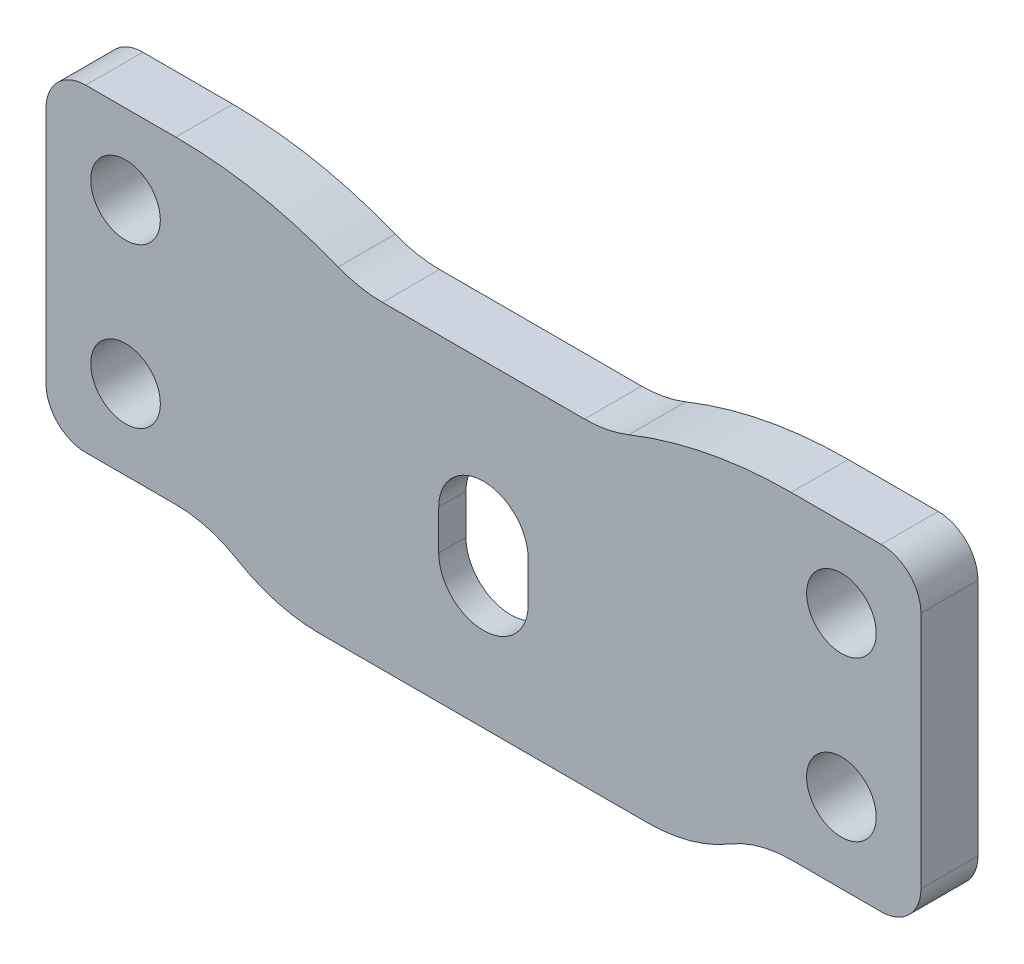
ISO-10303-21;
HEADER;
FILE_DESCRIPTION(('STEP AP214'),'2;1');
FILE_NAME('part.step','',(''),(''),'','','');
FILE_SCHEMA(('AUTOMOTIVE_DESIGN { 1 0 10303 214 1 1 1 1 }'));
ENDSEC;
DATA;
#1=APPLICATION_CONTEXT('core data for automotive mechanical design processes');
#2=APPLICATION_PROTOCOL_DEFINITION('international standard','automotive_design',2000,#1);
#3=PRODUCT_CONTEXT('',#1,'mechanical');
#4=PRODUCT('Part','Part','',(#3));
#5=PRODUCT_RELATED_PRODUCT_CATEGORY('part','',(#4));
#6=PRODUCT_DEFINITION_FORMATION('','',#4);
#7=PRODUCT_DEFINITION_CONTEXT('part definition',#1,'design');
#8=PRODUCT_DEFINITION('design','',#6,#7);
#9=PRODUCT_DEFINITION_SHAPE('','',#8);
#10=(LENGTH_UNIT() NAMED_UNIT(*) SI_UNIT(.MILLI.,.METRE.));
#11=(NAMED_UNIT(*) PLANE_ANGLE_UNIT() SI_UNIT($,.RADIAN.));
#12=(NAMED_UNIT(*) SI_UNIT($,.STERADIAN.) SOLID_ANGLE_UNIT());
#13=UNCERTAINTY_MEASURE_WITH_UNIT(LENGTH_MEASURE(1.E-05),#10,'distance_accuracy_value','');
#14=(GEOMETRIC_REPRESENTATION_CONTEXT(3) GLOBAL_UNCERTAINTY_ASSIGNED_CONTEXT((#13)) GLOBAL_UNIT_ASSIGNED_CONTEXT((#10,
#11,#12)) REPRESENTATION_CONTEXT('',''));
#15=CARTESIAN_POINT('',(0.,0.,0.));
#16=DIRECTION('',(0.,0.,1.));
#17=DIRECTION('',(1.,0.,0.));
#18=AXIS2_PLACEMENT_3D('',#15,#16,#17);
#19=CARTESIAN_POINT('',(34.925,12.7,4.55422));
#20=DIRECTION('',(0.,-1.,0.));
#21=DIRECTION('',(1.,0.,0.));
#22=AXIS2_PLACEMENT_3D('',#19,#20,#21);
#23=PLANE('',#22);
#24=DIRECTION('',(0.,0.,1.));
#25=VECTOR('',#24,1.);
#26=CARTESIAN_POINT('',(24.5620158285618,12.7,4.55422));
#27=LINE('',#26,#25);
#28=CARTESIAN_POINT('',(24.5620158285618,12.7,4.55422));
#29=VERTEX_POINT('',#28);
#30=CARTESIAN_POINT('',(24.5620158285618,12.7,0.));
#31=VERTEX_POINT('',#30);
#32=EDGE_CURVE('E260',#29,#31,#27,.F.);
#33=ORIENTED_EDGE('',*,*,#32,.F.);
#34=DIRECTION('',(-1.,0.,0.));
#35=VECTOR('',#34,1.);
#36=CARTESIAN_POINT('',(34.925,12.7,4.55422));
#37=LINE('',#36,#35);
#38=CARTESIAN_POINT('',(31.75,12.7,4.55422));
#39=VERTEX_POINT('',#38);
#40=EDGE_CURVE('E336',#39,#29,#37,.T.);
#41=ORIENTED_EDGE('',*,*,#40,.F.);
#42=DIRECTION('',(0.,0.,-1.));
#43=VECTOR('',#42,1.);
#44=CARTESIAN_POINT('',(31.75,12.7,4.55422));
#45=LINE('',#44,#43);
#46=CARTESIAN_POINT('',(31.75,12.7,0.));
#47=VERTEX_POINT('',#46);
#48=EDGE_CURVE('E383',#39,#47,#45,.T.);
#49=ORIENTED_EDGE('',*,*,#48,.T.);
#50=DIRECTION('',(-1.,0.,0.));
#51=VECTOR('',#50,1.);
#52=CARTESIAN_POINT('',(34.925,12.7,0.));
#53=LINE('',#52,#51);
#54=EDGE_CURVE('E328',#47,#31,#53,.T.);
#55=ORIENTED_EDGE('',*,*,#54,.T.);
#56=EDGE_LOOP('',(#33,#41,#49,#55));
#57=FACE_BOUND('',#56,.T.);
#58=ADVANCED_FACE('F38',(#57),#23,.F.);
#59=CARTESIAN_POINT('',(-34.925,-12.7,4.55422));
#60=DIRECTION('',(0.,0.,-1.));
#61=DIRECTION('',(-1.,0.,0.));
#62=AXIS2_PLACEMENT_3D('',#59,#60,#61);
#63=PLANE('',#62);
#64=DIRECTION('',(0.,-1.,0.));
#65=VECTOR('',#64,1.);
#66=CARTESIAN_POINT('',(-3.571875,-2.38125000000001,4.55422));
#67=LINE('',#66,#65);
#68=CARTESIAN_POINT('',(-3.571875,-2.38125000000001,4.55422));
#69=VERTEX_POINT('',#68);
#70=CARTESIAN_POINT('',(-3.571875,-5.55625000000001,4.55422));
#71=VERTEX_POINT('',#70);
#72=EDGE_CURVE('E203',#69,#71,#67,.T.);
#73=ORIENTED_EDGE('',*,*,#72,.F.);
#74=CARTESIAN_POINT('',(0.,-2.38125000000001,4.55422));
#75=DIRECTION('',(0.,0.,1.));
#76=DIRECTION('',(1.,0.,0.));
#77=AXIS2_PLACEMENT_3D('',#74,#75,#76);
#78=CIRCLE('',#77,3.571875);
#79=CARTESIAN_POINT('',(3.571875,-2.38125000000001,4.55422));
#80=VERTEX_POINT('',#79);
#81=EDGE_CURVE('E209',#80,#69,#78,.T.);
#82=ORIENTED_EDGE('',*,*,#81,.F.);
#83=DIRECTION('',(0.,1.,0.));
#84=VECTOR('',#83,1.);
#85=CARTESIAN_POINT('',(3.571875,-2.38125000000001,4.55422));
#86=LINE('',#85,#84);
#87=CARTESIAN_POINT('',(3.571875,-5.55625000000001,4.55422));
#88=VERTEX_POINT('',#87);
#89=EDGE_CURVE('E238',#88,#80,#86,.T.);
#90=ORIENTED_EDGE('',*,*,#89,.F.);
#91=CARTESIAN_POINT('',(0.,-5.55625000000001,4.55422));
#92=DIRECTION('',(0.,0.,1.));
#93=DIRECTION('',(1.,0.,0.));
#94=AXIS2_PLACEMENT_3D('',#91,#92,#93);
#95=CIRCLE('',#94,3.571875);
#96=EDGE_CURVE('E211',#71,#88,#95,.T.);
#97=ORIENTED_EDGE('',*,*,#96,.F.);
#98=EDGE_LOOP('',(#73,#82,#90,#97));
#99=FACE_BOUND('',#98,.T.);
#100=CARTESIAN_POINT('',(28.575,-6.35,4.55422));
#101=DIRECTION('',(0.,0.,1.));
#102=DIRECTION('',(1.,0.,0.));
#103=AXIS2_PLACEMENT_3D('',#100,#101,#102);
#104=CIRCLE('',#103,2.778125);
#105=CARTESIAN_POINT('',(31.353125,-6.35,4.55422));
#106=VERTEX_POINT('',#105);
#107=EDGE_CURVE('E317',#106,#106,#104,.T.);
#108=ORIENTED_EDGE('',*,*,#107,.F.);
#109=EDGE_LOOP('',(#108));
#110=FACE_BOUND('',#109,.T.);
#111=CARTESIAN_POINT('',(28.575,6.35000000000001,4.55422));
#112=DIRECTION('',(0.,0.,1.));
#113=DIRECTION('',(1.,0.,0.));
#114=AXIS2_PLACEMENT_3D('',#111,#112,#113);
#115=CIRCLE('',#114,2.778125);
#116=CARTESIAN_POINT('',(31.353125,6.35000000000001,4.55422));
#117=VERTEX_POINT('',#116);
#118=EDGE_CURVE('E311',#117,#117,#115,.T.);
#119=ORIENTED_EDGE('',*,*,#118,.F.);
#120=EDGE_LOOP('',(#119));
#121=FACE_BOUND('',#120,.T.);
#122=CARTESIAN_POINT('',(-28.575,-6.35,4.55422));
#123=DIRECTION('',(0.,0.,1.));
#124=DIRECTION('',(1.,0.,0.));
#125=AXIS2_PLACEMENT_3D('',#122,#123,#124);
#126=CIRCLE('',#125,2.778125);
#127=CARTESIAN_POINT('',(-25.796875,-6.35,4.55422));
#128=VERTEX_POINT('',#127);
#129=EDGE_CURVE('E305',#128,#128,#126,.T.);
#130=ORIENTED_EDGE('',*,*,#129,.F.);
#131=EDGE_LOOP('',(#130));
#132=FACE_BOUND('',#131,.T.);
#133=CARTESIAN_POINT('',(-28.575,6.35000000000001,4.55422));
#134=DIRECTION('',(0.,0.,1.));
#135=DIRECTION('',(1.,0.,0.));
#136=AXIS2_PLACEMENT_3D('',#133,#134,#135);
#137=CIRCLE('',#136,2.778125);
#138=CARTESIAN_POINT('',(-25.796875,6.35000000000001,4.55422));
#139=VERTEX_POINT('',#138);
#140=EDGE_CURVE('E297',#139,#139,#137,.T.);
#141=ORIENTED_EDGE('',*,*,#140,.F.);
#142=EDGE_LOOP('',(#141));
#143=FACE_BOUND('',#142,.T.);
#144=CARTESIAN_POINT('',(-24.5620158285618,-22.225,4.55422));
#145=DIRECTION('',(0.,0.,-1.));
#146=DIRECTION('',(-1.,0.,0.));
#147=AXIS2_PLACEMENT_3D('',#144,#145,#146);
#148=CIRCLE('',#147,9.525);
#149=CARTESIAN_POINT('',(-24.5620158285618,-12.7,4.55422));
#150=VERTEX_POINT('',#149);
#151=CARTESIAN_POINT('',(-19.6558907001626,-14.0607142857143,4.55422));
#152=VERTEX_POINT('',#151);
#153=EDGE_CURVE('E398',#150,#152,#148,.T.);
#154=ORIENTED_EDGE('',*,*,#153,.T.);
#155=CARTESIAN_POINT('',(-13.1143905289636,-3.17500000000001,4.55422));
#156=DIRECTION('',(0.,0.,-1.));
#157=DIRECTION('',(-1.,0.,0.));
#158=AXIS2_PLACEMENT_3D('',#155,#156,#157);
#159=CIRCLE('',#158,12.7);
#160=CARTESIAN_POINT('',(-13.1143905289636,-15.875,4.55422));
#161=VERTEX_POINT('',#160);
#162=EDGE_CURVE('E46',#152,#161,#159,.F.);
#163=ORIENTED_EDGE('',*,*,#162,.T.);
#164=DIRECTION('',(-1.,0.,0.));
#165=VECTOR('',#164,1.);
#166=CARTESIAN_POINT('',(17.4625,-15.875,4.55422));
#167=LINE('',#166,#165);
#168=CARTESIAN_POINT('',(13.1143905289637,-15.875,4.55422));
#169=VERTEX_POINT('',#168);
#170=EDGE_CURVE('E294',#169,#161,#167,.T.);
#171=ORIENTED_EDGE('',*,*,#170,.F.);
#172=CARTESIAN_POINT('',(13.1143905289637,-3.17500000000001,4.55422));
#173=DIRECTION('',(0.,0.,-1.));
#174=DIRECTION('',(-1.,0.,0.));
#175=AXIS2_PLACEMENT_3D('',#172,#173,#174);
#176=CIRCLE('',#175,12.7);
#177=CARTESIAN_POINT('',(19.6558907001626,-14.0607142857143,4.55422));
#178=VERTEX_POINT('',#177);
#179=EDGE_CURVE('E53',#169,#178,#176,.F.);
#180=ORIENTED_EDGE('',*,*,#179,.T.);
#181=CARTESIAN_POINT('',(24.5620158285619,-22.225,4.55422));
#182=DIRECTION('',(0.,0.,-1.));
#183=DIRECTION('',(-1.,0.,0.));
#184=AXIS2_PLACEMENT_3D('',#181,#182,#183);
#185=CIRCLE('',#184,9.525);
#186=CARTESIAN_POINT('',(24.5620158285619,-12.7,4.55422));
#187=VERTEX_POINT('',#186);
#188=EDGE_CURVE('E403',#178,#187,#185,.T.);
#189=ORIENTED_EDGE('',*,*,#188,.T.);
#190=DIRECTION('',(1.,0.,0.));
#191=VECTOR('',#190,1.);
#192=CARTESIAN_POINT('',(34.925,-12.7,4.55422));
#193=LINE('',#192,#191);
#194=CARTESIAN_POINT('',(31.75,-12.7,4.55422));
#195=VERTEX_POINT('',#194);
#196=EDGE_CURVE('E327',#187,#195,#193,.T.);
#197=ORIENTED_EDGE('',*,*,#196,.T.);
#198=CARTESIAN_POINT('',(31.75,-9.52499999999999,4.55422));
#199=DIRECTION('',(0.,0.,-1.));
#200=DIRECTION('',(-1.,0.,0.));
#201=AXIS2_PLACEMENT_3D('',#198,#199,#200);
#202=CIRCLE('',#201,3.175);
#203=CARTESIAN_POINT('',(34.925,-9.52499999999999,4.55422));
#204=VERTEX_POINT('',#203);
#205=EDGE_CURVE('E378',#195,#204,#202,.F.);
#206=ORIENTED_EDGE('',*,*,#205,.T.);
#207=DIRECTION('',(0.,1.,0.));
#208=VECTOR('',#207,1.);
#209=CARTESIAN_POINT('',(34.925,12.7,4.55422));
#210=LINE('',#209,#208);
#211=CARTESIAN_POINT('',(34.925,9.52500000000001,4.55422));
#212=VERTEX_POINT('',#211);
#213=EDGE_CURVE('E332',#204,#212,#210,.T.);
#214=ORIENTED_EDGE('',*,*,#213,.T.);
#215=CARTESIAN_POINT('',(31.75,9.52500000000001,4.55422));
#216=DIRECTION('',(0.,0.,-1.));
#217=DIRECTION('',(-1.,0.,0.));
#218=AXIS2_PLACEMENT_3D('',#215,#216,#217);
#219=CIRCLE('',#218,3.175);
#220=EDGE_CURVE('E376',#212,#39,#219,.F.);
#221=ORIENTED_EDGE('',*,*,#220,.T.);
#222=ORIENTED_EDGE('',*,*,#40,.T.);
#223=CARTESIAN_POINT('',(24.5620158285619,-22.225,4.55422));
#224=DIRECTION('',(0.,0.,-1.));
#225=DIRECTION('',(-1.,0.,0.));
#226=AXIS2_PLACEMENT_3D('',#223,#224,#225);
#227=CIRCLE('',#226,34.925);
#228=CARTESIAN_POINT('',(11.5994713026312,10.2053571428571,4.55422));
#229=VERTEX_POINT('',#228);
#230=EDGE_CURVE('E249',#229,#29,#227,.T.);
#231=ORIENTED_EDGE('',*,*,#230,.F.);
#232=CARTESIAN_POINT('',(8.06423188646827,19.05,4.55422));
#233=DIRECTION('',(0.,0.,-1.));
#234=DIRECTION('',(-1.,0.,0.));
#235=AXIS2_PLACEMENT_3D('',#232,#233,#234);
#236=CIRCLE('',#235,9.525);
#237=CARTESIAN_POINT('',(8.06423188646827,9.52499999999999,4.55422));
#238=VERTEX_POINT('',#237);
#239=EDGE_CURVE('E256',#238,#229,#236,.F.);
#240=ORIENTED_EDGE('',*,*,#239,.F.);
#241=DIRECTION('',(1.,0.,0.));
#242=VECTOR('',#241,1.);
#243=CARTESIAN_POINT('',(8.06423188646827,9.52499999999999,4.55422));
#244=LINE('',#243,#242);
#245=CARTESIAN_POINT('',(-8.06423188646825,9.52499999999999,4.55422));
#246=VERTEX_POINT('',#245);
#247=EDGE_CURVE('E274',#246,#238,#244,.T.);
#248=ORIENTED_EDGE('',*,*,#247,.F.);
#249=CARTESIAN_POINT('',(-8.06423188646825,19.05,4.55422));
#250=DIRECTION('',(0.,0.,-1.));
#251=DIRECTION('',(-1.,0.,0.));
#252=AXIS2_PLACEMENT_3D('',#249,#250,#251);
#253=CIRCLE('',#252,9.525);
#254=CARTESIAN_POINT('',(-11.5994713026312,10.2053571428571,4.55422));
#255=VERTEX_POINT('',#254);
#256=EDGE_CURVE('E272',#255,#246,#253,.F.);
#257=ORIENTED_EDGE('',*,*,#256,.F.);
#258=CARTESIAN_POINT('',(-24.5620158285618,-22.225,4.55422));
#259=DIRECTION('',(0.,0.,-1.));
#260=DIRECTION('',(-1.,0.,0.));
#261=AXIS2_PLACEMENT_3D('',#258,#259,#260);
#262=CIRCLE('',#261,34.925);
#263=CARTESIAN_POINT('',(-24.5620158285618,12.7,4.55422));
#264=VERTEX_POINT('',#263);
#265=EDGE_CURVE('E270',#264,#255,#262,.T.);
#266=ORIENTED_EDGE('',*,*,#265,.F.);
#267=CARTESIAN_POINT('',(-31.75,12.7,4.55422));
#268=VERTEX_POINT('',#267);
#269=EDGE_CURVE('E335',#264,#268,#37,.T.);
#270=ORIENTED_EDGE('',*,*,#269,.T.);
#271=CARTESIAN_POINT('',(-31.75,9.525,4.55422));
#272=DIRECTION('',(0.,0.,-1.));
#273=DIRECTION('',(-1.,0.,0.));
#274=AXIS2_PLACEMENT_3D('',#271,#272,#273);
#275=CIRCLE('',#274,3.175);
#276=CARTESIAN_POINT('',(-34.925,9.525,4.55422));
#277=VERTEX_POINT('',#276);
#278=EDGE_CURVE('E372',#268,#277,#275,.F.);
#279=ORIENTED_EDGE('',*,*,#278,.T.);
#280=DIRECTION('',(0.,-1.,0.));
#281=VECTOR('',#280,1.);
#282=CARTESIAN_POINT('',(-34.925,12.7,4.55422));
#283=LINE('',#282,#281);
#284=CARTESIAN_POINT('',(-34.925,-9.525,4.55422));
#285=VERTEX_POINT('',#284);
#286=EDGE_CURVE('E324',#277,#285,#283,.T.);
#287=ORIENTED_EDGE('',*,*,#286,.T.);
#288=CARTESIAN_POINT('',(-31.75,-9.525,4.55422));
#289=DIRECTION('',(0.,0.,-1.));
#290=DIRECTION('',(-1.,0.,0.));
#291=AXIS2_PLACEMENT_3D('',#288,#289,#290);
#292=CIRCLE('',#291,3.175);
#293=CARTESIAN_POINT('',(-31.75,-12.7,4.55422));
#294=VERTEX_POINT('',#293);
#295=EDGE_CURVE('E374',#285,#294,#292,.F.);
#296=ORIENTED_EDGE('',*,*,#295,.T.);
#297=EDGE_CURVE('E329',#294,#150,#193,.T.);
#298=ORIENTED_EDGE('',*,*,#297,.T.);
#299=EDGE_LOOP('',(#154,#163,#171,#180,#189,#197,#206,#214,#221,#222,#231,#240,#248,#257,#266,
#270,#279,#287,#296,#298));
#300=FACE_BOUND('',#299,.T.);
#301=ADVANCED_FACE('F205',(#99,#110,#121,#132,#143,#300),#63,.F.);
#302=CARTESIAN_POINT('',(-34.925,-12.7,0.));
#303=DIRECTION('',(0.,0.,-1.));
#304=DIRECTION('',(-1.,0.,0.));
#305=AXIS2_PLACEMENT_3D('',#302,#303,#304);
#306=PLANE('',#305);
#307=CARTESIAN_POINT('',(0.,-3.17500000000001,0.));
#308=DIRECTION('',(0.,0.,-1.));
#309=DIRECTION('',(-1.,0.,0.));
#310=AXIS2_PLACEMENT_3D('',#307,#308,#309);
#311=CIRCLE('',#310,9.525);
#312=CARTESIAN_POINT('',(-9.525,-3.17500000000001,0.));
#313=VERTEX_POINT('',#312);
#314=EDGE_CURVE('E245',#313,#313,#311,.T.);
#315=ORIENTED_EDGE('',*,*,#314,.F.);
#316=EDGE_LOOP('',(#315));
#317=FACE_BOUND('',#316,.T.);
#318=CARTESIAN_POINT('',(-28.575,6.35000000000001,0.));
#319=DIRECTION('',(0.,0.,-1.));
#320=DIRECTION('',(-1.,0.,0.));
#321=AXIS2_PLACEMENT_3D('',#318,#319,#320);
#322=CIRCLE('',#321,2.778125);
#323=CARTESIAN_POINT('',(-31.353125,6.35000000000001,0.));
#324=VERTEX_POINT('',#323);
#325=EDGE_CURVE('E302',#324,#324,#322,.T.);
#326=ORIENTED_EDGE('',*,*,#325,.F.);
#327=EDGE_LOOP('',(#326));
#328=FACE_BOUND('',#327,.T.);
#329=CARTESIAN_POINT('',(-28.575,-6.35,0.));
#330=DIRECTION('',(0.,0.,-1.));
#331=DIRECTION('',(-1.,0.,0.));
#332=AXIS2_PLACEMENT_3D('',#329,#330,#331);
#333=CIRCLE('',#332,2.778125);
#334=CARTESIAN_POINT('',(-31.353125,-6.35,0.));
#335=VERTEX_POINT('',#334);
#336=EDGE_CURVE('E308',#335,#335,#333,.T.);
#337=ORIENTED_EDGE('',*,*,#336,.F.);
#338=EDGE_LOOP('',(#337));
#339=FACE_BOUND('',#338,.T.);
#340=CARTESIAN_POINT('',(28.575,6.35000000000001,0.));
#341=DIRECTION('',(0.,0.,-1.));
#342=DIRECTION('',(-1.,0.,0.));
#343=AXIS2_PLACEMENT_3D('',#340,#341,#342);
#344=CIRCLE('',#343,2.778125);
#345=CARTESIAN_POINT('',(25.796875,6.35000000000001,0.));
#346=VERTEX_POINT('',#345);
#347=EDGE_CURVE('E314',#346,#346,#344,.T.);
#348=ORIENTED_EDGE('',*,*,#347,.F.);
#349=EDGE_LOOP('',(#348));
#350=FACE_BOUND('',#349,.T.);
#351=CARTESIAN_POINT('',(28.575,-6.35,0.));
#352=DIRECTION('',(0.,0.,-1.));
#353=DIRECTION('',(-1.,0.,0.));
#354=AXIS2_PLACEMENT_3D('',#351,#352,#353);
#355=CIRCLE('',#354,2.778125);
#356=CARTESIAN_POINT('',(25.796875,-6.35,0.));
#357=VERTEX_POINT('',#356);
#358=EDGE_CURVE('E320',#357,#357,#355,.T.);
#359=ORIENTED_EDGE('',*,*,#358,.F.);
#360=EDGE_LOOP('',(#359));
#361=FACE_BOUND('',#360,.T.);
#362=DIRECTION('',(-1.,0.,0.));
#363=VECTOR('',#362,1.);
#364=CARTESIAN_POINT('',(17.4625,-15.875,0.));
#365=LINE('',#364,#363);
#366=CARTESIAN_POINT('',(13.1143905289637,-15.875,0.));
#367=VERTEX_POINT('',#366);
#368=CARTESIAN_POINT('',(-13.1143905289636,-15.875,0.));
#369=VERTEX_POINT('',#368);
#370=EDGE_CURVE('E292',#367,#369,#365,.T.);
#371=ORIENTED_EDGE('',*,*,#370,.T.);
#372=CARTESIAN_POINT('',(-13.1143905289636,-3.17500000000001,0.));
#373=DIRECTION('',(0.,0.,-1.));
#374=DIRECTION('',(-1.,0.,0.));
#375=AXIS2_PLACEMENT_3D('',#372,#373,#374);
#376=CIRCLE('',#375,12.7);
#377=CARTESIAN_POINT('',(-19.6558907001626,-14.0607142857143,0.));
#378=VERTEX_POINT('',#377);
#379=EDGE_CURVE('E412',#369,#378,#376,.T.);
#380=ORIENTED_EDGE('',*,*,#379,.T.);
#381=CARTESIAN_POINT('',(-24.5620158285618,-22.225,0.));
#382=DIRECTION('',(0.,0.,-1.));
#383=DIRECTION('',(-1.,0.,0.));
#384=AXIS2_PLACEMENT_3D('',#381,#382,#383);
#385=CIRCLE('',#384,9.525);
#386=CARTESIAN_POINT('',(-24.5620158285618,-12.7,0.));
#387=VERTEX_POINT('',#386);
#388=EDGE_CURVE('E396',#378,#387,#385,.F.);
#389=ORIENTED_EDGE('',*,*,#388,.T.);
#390=DIRECTION('',(1.,0.,0.));
#391=VECTOR('',#390,1.);
#392=CARTESIAN_POINT('',(34.925,-12.7,0.));
#393=LINE('',#392,#391);
#394=CARTESIAN_POINT('',(-31.75,-12.7,0.));
#395=VERTEX_POINT('',#394);
#396=EDGE_CURVE('E343',#395,#387,#393,.T.);
#397=ORIENTED_EDGE('',*,*,#396,.F.);
#398=CARTESIAN_POINT('',(-31.75,-9.525,0.));
#399=DIRECTION('',(0.,0.,-1.));
#400=DIRECTION('',(-1.,0.,0.));
#401=AXIS2_PLACEMENT_3D('',#398,#399,#400);
#402=CIRCLE('',#401,3.175);
#403=CARTESIAN_POINT('',(-34.925,-9.525,0.));
#404=VERTEX_POINT('',#403);
#405=EDGE_CURVE('E359',#395,#404,#402,.T.);
#406=ORIENTED_EDGE('',*,*,#405,.T.);
#407=DIRECTION('',(0.,-1.,0.));
#408=VECTOR('',#407,1.);
#409=CARTESIAN_POINT('',(-34.925,12.7,0.));
#410=LINE('',#409,#408);
#411=CARTESIAN_POINT('',(-34.925,9.525,0.));
#412=VERTEX_POINT('',#411);
#413=EDGE_CURVE('E323',#412,#404,#410,.T.);
#414=ORIENTED_EDGE('',*,*,#413,.F.);
#415=CARTESIAN_POINT('',(-31.75,9.525,0.));
#416=DIRECTION('',(0.,0.,-1.));
#417=DIRECTION('',(-1.,0.,0.));
#418=AXIS2_PLACEMENT_3D('',#415,#416,#417);
#419=CIRCLE('',#418,3.175);
#420=CARTESIAN_POINT('',(-31.75,12.7,0.));
#421=VERTEX_POINT('',#420);
#422=EDGE_CURVE('E356',#412,#421,#419,.T.);
#423=ORIENTED_EDGE('',*,*,#422,.T.);
#424=CARTESIAN_POINT('',(-24.5620158285618,12.7,0.));
#425=VERTEX_POINT('',#424);
#426=EDGE_CURVE('E349',#425,#421,#53,.T.);
#427=ORIENTED_EDGE('',*,*,#426,.F.);
#428=CARTESIAN_POINT('',(-24.5620158285618,-22.225,0.));
#429=DIRECTION('',(0.,0.,-1.));
#430=DIRECTION('',(-1.,0.,0.));
#431=AXIS2_PLACEMENT_3D('',#428,#429,#430);
#432=CIRCLE('',#431,34.925);
#433=CARTESIAN_POINT('',(-11.5994713026312,10.2053571428571,0.));
#434=VERTEX_POINT('',#433);
#435=EDGE_CURVE('E255',#425,#434,#432,.T.);
#436=ORIENTED_EDGE('',*,*,#435,.T.);
#437=CARTESIAN_POINT('',(-8.06423188646825,19.05,0.));
#438=DIRECTION('',(0.,0.,-1.));
#439=DIRECTION('',(-1.,0.,0.));
#440=AXIS2_PLACEMENT_3D('',#437,#438,#439);
#441=CIRCLE('',#440,9.525);
#442=CARTESIAN_POINT('',(-8.06423188646825,9.52499999999999,0.));
#443=VERTEX_POINT('',#442);
#444=EDGE_CURVE('E264',#434,#443,#441,.F.);
#445=ORIENTED_EDGE('',*,*,#444,.T.);
#446=DIRECTION('',(-1.,0.,0.));
#447=VECTOR('',#446,1.);
#448=CARTESIAN_POINT('',(-34.925,9.52499999999999,0.));
#449=LINE('',#448,#447);
#450=CARTESIAN_POINT('',(8.06423188646827,9.52499999999999,0.));
#451=VERTEX_POINT('',#450);
#452=EDGE_CURVE('E261',#443,#451,#449,.F.);
#453=ORIENTED_EDGE('',*,*,#452,.T.);
#454=CARTESIAN_POINT('',(8.06423188646827,19.05,0.));
#455=DIRECTION('',(0.,0.,-1.));
#456=DIRECTION('',(-1.,0.,0.));
#457=AXIS2_PLACEMENT_3D('',#454,#455,#456);
#458=CIRCLE('',#457,9.525);
#459=CARTESIAN_POINT('',(11.5994713026312,10.2053571428571,0.));
#460=VERTEX_POINT('',#459);
#461=EDGE_CURVE('E257',#451,#460,#458,.F.);
#462=ORIENTED_EDGE('',*,*,#461,.T.);
#463=CARTESIAN_POINT('',(24.5620158285619,-22.225,0.));
#464=DIRECTION('',(0.,0.,-1.));
#465=DIRECTION('',(-1.,0.,0.));
#466=AXIS2_PLACEMENT_3D('',#463,#464,#465);
#467=CIRCLE('',#466,34.925);
#468=EDGE_CURVE('E252',#460,#31,#467,.T.);
#469=ORIENTED_EDGE('',*,*,#468,.T.);
#470=ORIENTED_EDGE('',*,*,#54,.F.);
#471=CARTESIAN_POINT('',(31.75,9.52500000000001,0.));
#472=DIRECTION('',(0.,0.,-1.));
#473=DIRECTION('',(-1.,0.,0.));
#474=AXIS2_PLACEMENT_3D('',#471,#472,#473);
#475=CIRCLE('',#474,3.175);
#476=CARTESIAN_POINT('',(34.925,9.52500000000001,0.));
#477=VERTEX_POINT('',#476);
#478=EDGE_CURVE('E361',#47,#477,#475,.T.);
#479=ORIENTED_EDGE('',*,*,#478,.T.);
#480=DIRECTION('',(0.,1.,0.));
#481=VECTOR('',#480,1.);
#482=CARTESIAN_POINT('',(34.925,12.7,0.));
#483=LINE('',#482,#481);
#484=CARTESIAN_POINT('',(34.925,-9.52499999999999,0.));
#485=VERTEX_POINT('',#484);
#486=EDGE_CURVE('E346',#485,#477,#483,.T.);
#487=ORIENTED_EDGE('',*,*,#486,.F.);
#488=CARTESIAN_POINT('',(31.75,-9.52499999999999,0.));
#489=DIRECTION('',(0.,0.,-1.));
#490=DIRECTION('',(-1.,0.,0.));
#491=AXIS2_PLACEMENT_3D('',#488,#489,#490);
#492=CIRCLE('',#491,3.175);
#493=CARTESIAN_POINT('',(31.75,-12.7,0.));
#494=VERTEX_POINT('',#493);
#495=EDGE_CURVE('E363',#485,#494,#492,.T.);
#496=ORIENTED_EDGE('',*,*,#495,.T.);
#497=CARTESIAN_POINT('',(24.5620158285619,-12.7,0.));
#498=VERTEX_POINT('',#497);
#499=EDGE_CURVE('E342',#498,#494,#393,.T.);
#500=ORIENTED_EDGE('',*,*,#499,.F.);
#501=CARTESIAN_POINT('',(24.5620158285619,-22.225,0.));
#502=DIRECTION('',(0.,0.,-1.));
#503=DIRECTION('',(-1.,0.,0.));
#504=AXIS2_PLACEMENT_3D('',#501,#502,#503);
#505=CIRCLE('',#504,9.525);
#506=CARTESIAN_POINT('',(19.6558907001626,-14.0607142857143,0.));
#507=VERTEX_POINT('',#506);
#508=EDGE_CURVE('E400',#498,#507,#505,.F.);
#509=ORIENTED_EDGE('',*,*,#508,.T.);
#510=CARTESIAN_POINT('',(13.1143905289637,-3.17500000000001,0.));
#511=DIRECTION('',(0.,0.,-1.));
#512=DIRECTION('',(-1.,0.,0.));
#513=AXIS2_PLACEMENT_3D('',#510,#511,#512);
#514=CIRCLE('',#513,12.7);
#515=EDGE_CURVE('E410',#507,#367,#514,.T.);
#516=ORIENTED_EDGE('',*,*,#515,.T.);
#517=EDGE_LOOP('',(#371,#380,#389,#397,#406,#414,#423,#427,#436,#445,#453,#462,#469,#470,#479,
#487,#496,#500,#509,#516));
#518=FACE_BOUND('',#517,.T.);
#519=ADVANCED_FACE('F424',(#317,#328,#339,#350,#361,#518),#306,.T.);
#520=CARTESIAN_POINT('',(34.925,-12.7,4.55422));
#521=DIRECTION('',(0.,1.,0.));
#522=DIRECTION('',(-1.,0.,0.));
#523=AXIS2_PLACEMENT_3D('',#520,#521,#522);
#524=PLANE('',#523);
#525=ORIENTED_EDGE('',*,*,#196,.F.);
#526=DIRECTION('',(0.,0.,-1.));
#527=VECTOR('',#526,1.);
#528=CARTESIAN_POINT('',(24.5620158285619,-12.7,4.55422));
#529=LINE('',#528,#527);
#530=EDGE_CURVE('E393',#187,#498,#529,.T.);
#531=ORIENTED_EDGE('',*,*,#530,.T.);
#532=ORIENTED_EDGE('',*,*,#499,.T.);
#533=DIRECTION('',(0.,0.,-1.));
#534=VECTOR('',#533,1.);
#535=CARTESIAN_POINT('',(31.75,-12.7,4.55422));
#536=LINE('',#535,#534);
#537=EDGE_CURVE('E369',#494,#195,#536,.F.);
#538=ORIENTED_EDGE('',*,*,#537,.T.);
#539=EDGE_LOOP('',(#525,#531,#532,#538));
#540=FACE_BOUND('',#539,.T.);
#541=ADVANCED_FACE('F489',(#540),#524,.F.);
#542=CARTESIAN_POINT('',(-34.925,12.7,4.55422));
#543=DIRECTION('',(1.,0.,0.));
#544=DIRECTION('',(0.,0.,-1.));
#545=AXIS2_PLACEMENT_3D('',#542,#543,#544);
#546=PLANE('',#545);
#547=ORIENTED_EDGE('',*,*,#413,.T.);
#548=DIRECTION('',(0.,0.,-1.));
#549=VECTOR('',#548,1.);
#550=CARTESIAN_POINT('',(-34.925,-9.525,4.55422));
#551=LINE('',#550,#549);
#552=EDGE_CURVE('E389',#404,#285,#551,.F.);
#553=ORIENTED_EDGE('',*,*,#552,.T.);
#554=ORIENTED_EDGE('',*,*,#286,.F.);
#555=DIRECTION('',(0.,0.,-1.));
#556=VECTOR('',#555,1.);
#557=CARTESIAN_POINT('',(-34.925,9.525,4.55422));
#558=LINE('',#557,#556);
#559=EDGE_CURVE('E386',#277,#412,#558,.T.);
#560=ORIENTED_EDGE('',*,*,#559,.T.);
#561=EDGE_LOOP('',(#547,#553,#554,#560));
#562=FACE_BOUND('',#561,.T.);
#563=ADVANCED_FACE('F439',(#562),#546,.F.);
#564=ORIENTED_EDGE('',*,*,#396,.T.);
#565=DIRECTION('',(0.,0.,1.));
#566=VECTOR('',#565,1.);
#567=CARTESIAN_POINT('',(-24.5620158285618,-12.7,4.55422));
#568=LINE('',#567,#566);
#569=EDGE_CURVE('E391',#387,#150,#568,.T.);
#570=ORIENTED_EDGE('',*,*,#569,.T.);
#571=ORIENTED_EDGE('',*,*,#297,.F.);
#572=DIRECTION('',(0.,0.,-1.));
#573=VECTOR('',#572,1.);
#574=CARTESIAN_POINT('',(-31.75,-12.7,4.55422));
#575=LINE('',#574,#573);
#576=EDGE_CURVE('E366',#294,#395,#575,.T.);
#577=ORIENTED_EDGE('',*,*,#576,.T.);
#578=EDGE_LOOP('',(#564,#570,#571,#577));
#579=FACE_BOUND('',#578,.T.);
#580=ADVANCED_FACE('F430',(#579),#524,.F.);
#581=CARTESIAN_POINT('',(34.925,12.7,4.55422));
#582=DIRECTION('',(-1.,0.,0.));
#583=DIRECTION('',(0.,-1.,0.));
#584=AXIS2_PLACEMENT_3D('',#581,#582,#583);
#585=PLANE('',#584);
#586=ORIENTED_EDGE('',*,*,#213,.F.);
#587=DIRECTION('',(0.,0.,-1.));
#588=VECTOR('',#587,1.);
#589=CARTESIAN_POINT('',(34.925,-9.52499999999999,4.55422));
#590=LINE('',#589,#588);
#591=EDGE_CURVE('E353',#204,#485,#590,.T.);
#592=ORIENTED_EDGE('',*,*,#591,.T.);
#593=ORIENTED_EDGE('',*,*,#486,.T.);
#594=DIRECTION('',(0.,0.,-1.));
#595=VECTOR('',#594,1.);
#596=CARTESIAN_POINT('',(34.925,9.52500000000001,4.55422));
#597=LINE('',#596,#595);
#598=EDGE_CURVE('E339',#477,#212,#597,.F.);
#599=ORIENTED_EDGE('',*,*,#598,.T.);
#600=EDGE_LOOP('',(#586,#592,#593,#599));
#601=FACE_BOUND('',#600,.T.);
#602=ADVANCED_FACE('F480',(#601),#585,.F.);
#603=ORIENTED_EDGE('',*,*,#269,.F.);
#604=DIRECTION('',(0.,0.,1.));
#605=VECTOR('',#604,1.);
#606=CARTESIAN_POINT('',(-24.5620158285618,12.7,4.55422));
#607=LINE('',#606,#605);
#608=EDGE_CURVE('E289',#264,#425,#607,.F.);
#609=ORIENTED_EDGE('',*,*,#608,.T.);
#610=ORIENTED_EDGE('',*,*,#426,.T.);
#611=DIRECTION('',(0.,0.,-1.));
#612=VECTOR('',#611,1.);
#613=CARTESIAN_POINT('',(-31.75,12.7,4.55422));
#614=LINE('',#613,#612);
#615=EDGE_CURVE('E380',#421,#268,#614,.F.);
#616=ORIENTED_EDGE('',*,*,#615,.T.);
#617=EDGE_LOOP('',(#603,#609,#610,#616));
#618=FACE_BOUND('',#617,.T.);
#619=ADVANCED_FACE('F448',(#618),#23,.F.);
#620=CARTESIAN_POINT('',(28.575,-6.35,4.55422));
#621=DIRECTION('',(0.,0.,1.));
#622=DIRECTION('',(1.,0.,0.));
#623=AXIS2_PLACEMENT_3D('',#620,#621,#622);
#624=CYLINDRICAL_SURFACE('',#623,2.778125);
#625=ORIENTED_EDGE('',*,*,#107,.T.);
#626=EDGE_LOOP('',(#625));
#627=FACE_BOUND('',#626,.T.);
#628=ORIENTED_EDGE('',*,*,#358,.T.);
#629=EDGE_LOOP('',(#628));
#630=FACE_BOUND('',#629,.T.);
#631=ADVANCED_FACE('F512',(#627,#630),#624,.F.);
#632=CARTESIAN_POINT('',(28.575,6.35000000000001,4.55422));
#633=DIRECTION('',(0.,0.,1.));
#634=DIRECTION('',(1.,0.,0.));
#635=AXIS2_PLACEMENT_3D('',#632,#633,#634);
#636=CYLINDRICAL_SURFACE('',#635,2.778125);
#637=ORIENTED_EDGE('',*,*,#118,.T.);
#638=EDGE_LOOP('',(#637));
#639=FACE_BOUND('',#638,.T.);
#640=ORIENTED_EDGE('',*,*,#347,.T.);
#641=EDGE_LOOP('',(#640));
#642=FACE_BOUND('',#641,.T.);
#643=ADVANCED_FACE('F517',(#639,#642),#636,.F.);
#644=CARTESIAN_POINT('',(-28.575,-6.35,4.55422));
#645=DIRECTION('',(0.,0.,1.));
#646=DIRECTION('',(1.,0.,0.));
#647=AXIS2_PLACEMENT_3D('',#644,#645,#646);
#648=CYLINDRICAL_SURFACE('',#647,2.778125);
#649=ORIENTED_EDGE('',*,*,#129,.T.);
#650=EDGE_LOOP('',(#649));
#651=FACE_BOUND('',#650,.T.);
#652=ORIENTED_EDGE('',*,*,#336,.T.);
#653=EDGE_LOOP('',(#652));
#654=FACE_BOUND('',#653,.T.);
#655=ADVANCED_FACE('F553',(#651,#654),#648,.F.);
#656=CARTESIAN_POINT('',(-28.575,6.35000000000001,4.55422));
#657=DIRECTION('',(0.,0.,1.));
#658=DIRECTION('',(1.,0.,0.));
#659=AXIS2_PLACEMENT_3D('',#656,#657,#658);
#660=CYLINDRICAL_SURFACE('',#659,2.778125);
#661=ORIENTED_EDGE('',*,*,#140,.T.);
#662=EDGE_LOOP('',(#661));
#663=FACE_BOUND('',#662,.T.);
#664=ORIENTED_EDGE('',*,*,#325,.T.);
#665=EDGE_LOOP('',(#664));
#666=FACE_BOUND('',#665,.T.);
#667=ADVANCED_FACE('F529',(#663,#666),#660,.F.);
#668=CARTESIAN_POINT('',(31.75,-9.52499999999999,4.55422));
#669=DIRECTION('',(0.,0.,-1.));
#670=DIRECTION('',(-1.,0.,0.));
#671=AXIS2_PLACEMENT_3D('',#668,#669,#670);
#672=CYLINDRICAL_SURFACE('',#671,3.175);
#673=ORIENTED_EDGE('',*,*,#205,.F.);
#674=ORIENTED_EDGE('',*,*,#537,.F.);
#675=ORIENTED_EDGE('',*,*,#495,.F.);
#676=ORIENTED_EDGE('',*,*,#591,.F.);
#677=EDGE_LOOP('',(#673,#674,#675,#676));
#678=FACE_BOUND('',#677,.T.);
#679=ADVANCED_FACE('F484',(#678),#672,.T.);
#680=CARTESIAN_POINT('',(31.75,9.52500000000001,4.55422));
#681=DIRECTION('',(0.,0.,-1.));
#682=DIRECTION('',(-1.,0.,0.));
#683=AXIS2_PLACEMENT_3D('',#680,#681,#682);
#684=CYLINDRICAL_SURFACE('',#683,3.175);
#685=ORIENTED_EDGE('',*,*,#220,.F.);
#686=ORIENTED_EDGE('',*,*,#598,.F.);
#687=ORIENTED_EDGE('',*,*,#478,.F.);
#688=ORIENTED_EDGE('',*,*,#48,.F.);
#689=EDGE_LOOP('',(#685,#686,#687,#688));
#690=FACE_BOUND('',#689,.T.);
#691=ADVANCED_FACE('F475',(#690),#684,.T.);
#692=CARTESIAN_POINT('',(-31.75,-9.525,4.55422));
#693=DIRECTION('',(0.,0.,-1.));
#694=DIRECTION('',(-1.,0.,0.));
#695=AXIS2_PLACEMENT_3D('',#692,#693,#694);
#696=CYLINDRICAL_SURFACE('',#695,3.175);
#697=ORIENTED_EDGE('',*,*,#295,.F.);
#698=ORIENTED_EDGE('',*,*,#552,.F.);
#699=ORIENTED_EDGE('',*,*,#405,.F.);
#700=ORIENTED_EDGE('',*,*,#576,.F.);
#701=EDGE_LOOP('',(#697,#698,#699,#700));
#702=FACE_BOUND('',#701,.T.);
#703=ADVANCED_FACE('F436',(#702),#696,.T.);
#704=CARTESIAN_POINT('',(-31.75,9.525,4.55422));
#705=DIRECTION('',(0.,0.,-1.));
#706=DIRECTION('',(-1.,0.,0.));
#707=AXIS2_PLACEMENT_3D('',#704,#705,#706);
#708=CYLINDRICAL_SURFACE('',#707,3.175);
#709=ORIENTED_EDGE('',*,*,#278,.F.);
#710=ORIENTED_EDGE('',*,*,#615,.F.);
#711=ORIENTED_EDGE('',*,*,#422,.F.);
#712=ORIENTED_EDGE('',*,*,#559,.F.);
#713=EDGE_LOOP('',(#709,#710,#711,#712));
#714=FACE_BOUND('',#713,.T.);
#715=ADVANCED_FACE('F443',(#714),#708,.T.);
#716=CARTESIAN_POINT('',(17.4625,-15.875,4.55422));
#717=DIRECTION('',(0.,-1.,0.));
#718=DIRECTION('',(0.,0.,-1.));
#719=AXIS2_PLACEMENT_3D('',#716,#717,#718);
#720=PLANE('',#719);
#721=ORIENTED_EDGE('',*,*,#170,.T.);
#722=DIRECTION('',(0.,0.,-1.));
#723=VECTOR('',#722,1.);
#724=CARTESIAN_POINT('',(-13.1143905289636,-15.875,0.));
#725=LINE('',#724,#723);
#726=EDGE_CURVE('E407',#161,#369,#725,.T.);
#727=ORIENTED_EDGE('',*,*,#726,.T.);
#728=ORIENTED_EDGE('',*,*,#370,.F.);
#729=DIRECTION('',(0.,0.,1.));
#730=VECTOR('',#729,1.);
#731=CARTESIAN_POINT('',(13.1143905289637,-15.875,4.55422));
#732=LINE('',#731,#730);
#733=EDGE_CURVE('E405',#367,#169,#732,.T.);
#734=ORIENTED_EDGE('',*,*,#733,.T.);
#735=EDGE_LOOP('',(#721,#727,#728,#734));
#736=FACE_BOUND('',#735,.T.);
#737=ADVANCED_FACE('F419',(#736),#720,.T.);
#738=CARTESIAN_POINT('',(-24.5620158285618,-22.225,4.55422));
#739=DIRECTION('',(0.,0.,1.));
#740=DIRECTION('',(1.,0.,0.));
#741=AXIS2_PLACEMENT_3D('',#738,#739,#740);
#742=CYLINDRICAL_SURFACE('',#741,9.525);
#743=ORIENTED_EDGE('',*,*,#388,.F.);
#744=DIRECTION('',(0.,0.,1.));
#745=VECTOR('',#744,1.);
#746=CARTESIAN_POINT('',(-19.6558907001626,-14.0607142857143,4.55422));
#747=LINE('',#746,#745);
#748=EDGE_CURVE('E61',#378,#152,#747,.T.);
#749=ORIENTED_EDGE('',*,*,#748,.T.);
#750=ORIENTED_EDGE('',*,*,#153,.F.);
#751=ORIENTED_EDGE('',*,*,#569,.F.);
#752=EDGE_LOOP('',(#743,#749,#750,#751));
#753=FACE_BOUND('',#752,.T.);
#754=ADVANCED_FACE('F427',(#753),#742,.F.);
#755=CARTESIAN_POINT('',(24.5620158285619,-22.225,4.55422));
#756=DIRECTION('',(0.,0.,-1.));
#757=DIRECTION('',(-1.,0.,0.));
#758=AXIS2_PLACEMENT_3D('',#755,#756,#757);
#759=CYLINDRICAL_SURFACE('',#758,9.525);
#760=ORIENTED_EDGE('',*,*,#188,.F.);
#761=DIRECTION('',(0.,0.,-1.));
#762=VECTOR('',#761,1.);
#763=CARTESIAN_POINT('',(19.6558907001626,-14.0607142857143,4.55422));
#764=LINE('',#763,#762);
#765=EDGE_CURVE('E11',#178,#507,#764,.T.);
#766=ORIENTED_EDGE('',*,*,#765,.T.);
#767=ORIENTED_EDGE('',*,*,#508,.F.);
#768=ORIENTED_EDGE('',*,*,#530,.F.);
#769=EDGE_LOOP('',(#760,#766,#767,#768));
#770=FACE_BOUND('',#769,.T.);
#771=ADVANCED_FACE('F492',(#770),#759,.F.);
#772=CARTESIAN_POINT('',(-24.5620158285618,-22.225,4.55422));
#773=DIRECTION('',(0.,0.,-1.));
#774=DIRECTION('',(-1.,0.,0.));
#775=AXIS2_PLACEMENT_3D('',#772,#773,#774);
#776=CYLINDRICAL_SURFACE('',#775,34.925);
#777=ORIENTED_EDGE('',*,*,#608,.F.);
#778=ORIENTED_EDGE('',*,*,#265,.T.);
#779=DIRECTION('',(0.,0.,1.));
#780=VECTOR('',#779,1.);
#781=CARTESIAN_POINT('',(-11.5994713026312,10.2053571428571,4.55422));
#782=LINE('',#781,#780);
#783=EDGE_CURVE('E286',#255,#434,#782,.F.);
#784=ORIENTED_EDGE('',*,*,#783,.T.);
#785=ORIENTED_EDGE('',*,*,#435,.F.);
#786=EDGE_LOOP('',(#777,#778,#784,#785));
#787=FACE_BOUND('',#786,.T.);
#788=ADVANCED_FACE('F451',(#787),#776,.T.);
#789=CARTESIAN_POINT('',(-8.06423188646825,19.05,4.55422));
#790=DIRECTION('',(0.,0.,-1.));
#791=DIRECTION('',(-1.,0.,0.));
#792=AXIS2_PLACEMENT_3D('',#789,#790,#791);
#793=CYLINDRICAL_SURFACE('',#792,9.525);
#794=ORIENTED_EDGE('',*,*,#783,.F.);
#795=ORIENTED_EDGE('',*,*,#256,.T.);
#796=DIRECTION('',(0.,0.,1.));
#797=VECTOR('',#796,1.);
#798=CARTESIAN_POINT('',(-8.06423188646825,9.52499999999999,4.55422));
#799=LINE('',#798,#797);
#800=EDGE_CURVE('E283',#246,#443,#799,.F.);
#801=ORIENTED_EDGE('',*,*,#800,.T.);
#802=ORIENTED_EDGE('',*,*,#444,.F.);
#803=EDGE_LOOP('',(#794,#795,#801,#802));
#804=FACE_BOUND('',#803,.T.);
#805=ADVANCED_FACE('F458',(#804),#793,.F.);
#806=CARTESIAN_POINT('',(8.06423188646827,9.52499999999999,4.55422));
#807=DIRECTION('',(0.,1.,0.));
#808=DIRECTION('',(1.,0.,0.));
#809=AXIS2_PLACEMENT_3D('',#806,#807,#808);
#810=PLANE('',#809);
#811=ORIENTED_EDGE('',*,*,#800,.F.);
#812=ORIENTED_EDGE('',*,*,#247,.T.);
#813=DIRECTION('',(0.,0.,1.));
#814=VECTOR('',#813,1.);
#815=CARTESIAN_POINT('',(8.06423188646827,9.52499999999999,4.55422));
#816=LINE('',#815,#814);
#817=EDGE_CURVE('E280',#238,#451,#816,.F.);
#818=ORIENTED_EDGE('',*,*,#817,.T.);
#819=ORIENTED_EDGE('',*,*,#452,.F.);
#820=EDGE_LOOP('',(#811,#812,#818,#819));
#821=FACE_BOUND('',#820,.T.);
#822=ADVANCED_FACE('F460',(#821),#810,.T.);
#823=CARTESIAN_POINT('',(8.06423188646827,19.05,4.55422));
#824=DIRECTION('',(0.,0.,-1.));
#825=DIRECTION('',(-1.,0.,0.));
#826=AXIS2_PLACEMENT_3D('',#823,#824,#825);
#827=CYLINDRICAL_SURFACE('',#826,9.525);
#828=ORIENTED_EDGE('',*,*,#817,.F.);
#829=ORIENTED_EDGE('',*,*,#239,.T.);
#830=DIRECTION('',(0.,0.,1.));
#831=VECTOR('',#830,1.);
#832=CARTESIAN_POINT('',(11.5994713026312,10.2053571428571,4.55422));
#833=LINE('',#832,#831);
#834=EDGE_CURVE('E277',#229,#460,#833,.F.);
#835=ORIENTED_EDGE('',*,*,#834,.T.);
#836=ORIENTED_EDGE('',*,*,#461,.F.);
#837=EDGE_LOOP('',(#828,#829,#835,#836));
#838=FACE_BOUND('',#837,.T.);
#839=ADVANCED_FACE('F464',(#838),#827,.F.);
#840=CARTESIAN_POINT('',(24.5620158285619,-22.225,4.55422));
#841=DIRECTION('',(0.,0.,-1.));
#842=DIRECTION('',(-1.,0.,0.));
#843=AXIS2_PLACEMENT_3D('',#840,#841,#842);
#844=CYLINDRICAL_SURFACE('',#843,34.925);
#845=ORIENTED_EDGE('',*,*,#834,.F.);
#846=ORIENTED_EDGE('',*,*,#230,.T.);
#847=ORIENTED_EDGE('',*,*,#32,.T.);
#848=ORIENTED_EDGE('',*,*,#468,.F.);
#849=EDGE_LOOP('',(#845,#846,#847,#848));
#850=FACE_BOUND('',#849,.T.);
#851=ADVANCED_FACE('F468',(#850),#844,.T.);
#852=CARTESIAN_POINT('',(0.,-3.17500000000001,2.38125));
#853=DIRECTION('',(0.,0.,-1.));
#854=DIRECTION('',(-1.,0.,0.));
#855=AXIS2_PLACEMENT_3D('',#852,#853,#854);
#856=CYLINDRICAL_SURFACE('',#855,9.525);
#857=CARTESIAN_POINT('',(0.,-3.17500000000001,2.38125));
#858=DIRECTION('',(0.,0.,-1.));
#859=DIRECTION('',(-1.,0.,0.));
#860=AXIS2_PLACEMENT_3D('',#857,#858,#859);
#861=CIRCLE('',#860,9.525);
#862=CARTESIAN_POINT('',(-9.525,-3.17500000000001,2.38125));
#863=VERTEX_POINT('',#862);
#864=EDGE_CURVE('E246',#863,#863,#861,.T.);
#865=ORIENTED_EDGE('',*,*,#864,.F.);
#866=EDGE_LOOP('',(#865));
#867=FACE_BOUND('',#866,.T.);
#868=ORIENTED_EDGE('',*,*,#314,.T.);
#869=EDGE_LOOP('',(#868));
#870=FACE_BOUND('',#869,.T.);
#871=ADVANCED_FACE('F579',(#867,#870),#856,.F.);
#872=CARTESIAN_POINT('',(0.,-3.17500000000001,2.38125));
#873=DIRECTION('',(0.,0.,-1.));
#874=DIRECTION('',(-1.,0.,0.));
#875=AXIS2_PLACEMENT_3D('',#872,#873,#874);
#876=PLANE('',#875);
#877=CARTESIAN_POINT('',(0.,-2.38125000000001,2.38125));
#878=DIRECTION('',(0.,0.,-1.));
#879=DIRECTION('',(-1.,0.,0.));
#880=AXIS2_PLACEMENT_3D('',#877,#878,#879);
#881=CIRCLE('',#880,3.571875);
#882=CARTESIAN_POINT('',(3.571875,-2.38125000000001,2.38125));
#883=VERTEX_POINT('',#882);
#884=CARTESIAN_POINT('',(-3.571875,-2.38125000000001,2.38125));
#885=VERTEX_POINT('',#884);
#886=EDGE_CURVE('E224',#883,#885,#881,.F.);
#887=ORIENTED_EDGE('',*,*,#886,.T.);
#888=DIRECTION('',(0.,-1.,0.));
#889=VECTOR('',#888,1.);
#890=CARTESIAN_POINT('',(-3.571875,-2.38125000000001,2.38125));
#891=LINE('',#890,#889);
#892=CARTESIAN_POINT('',(-3.571875,-5.55625000000001,2.38125));
#893=VERTEX_POINT('',#892);
#894=EDGE_CURVE('E219',#885,#893,#891,.T.);
#895=ORIENTED_EDGE('',*,*,#894,.T.);
#896=CARTESIAN_POINT('',(0.,-5.55625000000001,2.38125));
#897=DIRECTION('',(0.,0.,-1.));
#898=DIRECTION('',(-1.,0.,0.));
#899=AXIS2_PLACEMENT_3D('',#896,#897,#898);
#900=CIRCLE('',#899,3.571875);
#901=CARTESIAN_POINT('',(3.571875,-5.55625000000001,2.38125));
#902=VERTEX_POINT('',#901);
#903=EDGE_CURVE('E232',#893,#902,#900,.F.);
#904=ORIENTED_EDGE('',*,*,#903,.T.);
#905=DIRECTION('',(0.,1.,0.));
#906=VECTOR('',#905,1.);
#907=CARTESIAN_POINT('',(3.571875,-2.38125000000001,2.38125));
#908=LINE('',#907,#906);
#909=EDGE_CURVE('E213',#902,#883,#908,.T.);
#910=ORIENTED_EDGE('',*,*,#909,.T.);
#911=EDGE_LOOP('',(#887,#895,#904,#910));
#912=FACE_BOUND('',#911,.T.);
#913=ORIENTED_EDGE('',*,*,#864,.T.);
#914=EDGE_LOOP('',(#913));
#915=FACE_BOUND('',#914,.T.);
#916=ADVANCED_FACE('F502',(#912,#915),#876,.T.);
#917=CARTESIAN_POINT('',(-13.1143905289636,-3.17500000000001,4.55422));
#918=DIRECTION('',(0.,0.,1.));
#919=DIRECTION('',(1.,0.,0.));
#920=AXIS2_PLACEMENT_3D('',#917,#918,#919);
#921=CYLINDRICAL_SURFACE('',#920,12.7);
#922=ORIENTED_EDGE('',*,*,#162,.F.);
#923=ORIENTED_EDGE('',*,*,#748,.F.);
#924=ORIENTED_EDGE('',*,*,#379,.F.);
#925=ORIENTED_EDGE('',*,*,#726,.F.);
#926=EDGE_LOOP('',(#922,#923,#924,#925));
#927=FACE_BOUND('',#926,.T.);
#928=ADVANCED_FACE('F422',(#927),#921,.T.);
#929=CARTESIAN_POINT('',(13.1143905289637,-3.17500000000001,4.55422));
#930=DIRECTION('',(0.,0.,-1.));
#931=DIRECTION('',(-1.,0.,0.));
#932=AXIS2_PLACEMENT_3D('',#929,#930,#931);
#933=CYLINDRICAL_SURFACE('',#932,12.7);
#934=ORIENTED_EDGE('',*,*,#179,.F.);
#935=ORIENTED_EDGE('',*,*,#733,.F.);
#936=ORIENTED_EDGE('',*,*,#515,.F.);
#937=ORIENTED_EDGE('',*,*,#765,.F.);
#938=EDGE_LOOP('',(#934,#935,#936,#937));
#939=FACE_BOUND('',#938,.T.);
#940=ADVANCED_FACE('F40',(#939),#933,.T.);
#941=CARTESIAN_POINT('',(-3.571875,-2.38125000000001,-0.00100000000000013));
#942=DIRECTION('',(-1.,0.,0.));
#943=DIRECTION('',(0.,-1.,0.));
#944=AXIS2_PLACEMENT_3D('',#941,#942,#943);
#945=PLANE('',#944);
#946=ORIENTED_EDGE('',*,*,#894,.F.);
#947=DIRECTION('',(0.,0.,1.));
#948=VECTOR('',#947,1.);
#949=CARTESIAN_POINT('',(-3.571875,-2.38125000000001,-0.00100000000000013));
#950=LINE('',#949,#948);
#951=EDGE_CURVE('E216',#885,#69,#950,.T.);
#952=ORIENTED_EDGE('',*,*,#951,.T.);
#953=ORIENTED_EDGE('',*,*,#72,.T.);
#954=DIRECTION('',(0.,0.,1.));
#955=VECTOR('',#954,1.);
#956=CARTESIAN_POINT('',(-3.571875,-5.55625000000001,-0.00100000000000013));
#957=LINE('',#956,#955);
#958=EDGE_CURVE('E240',#893,#71,#957,.T.);
#959=ORIENTED_EDGE('',*,*,#958,.F.);
#960=EDGE_LOOP('',(#946,#952,#953,#959));
#961=FACE_BOUND('',#960,.T.);
#962=ADVANCED_FACE('F217',(#961),#945,.F.);
#963=CARTESIAN_POINT('',(0.,-5.55625000000001,-0.00100000000000013));
#964=DIRECTION('',(0.,0.,1.));
#965=DIRECTION('',(1.,0.,0.));
#966=AXIS2_PLACEMENT_3D('',#963,#964,#965);
#967=CYLINDRICAL_SURFACE('',#966,3.571875);
#968=ORIENTED_EDGE('',*,*,#958,.T.);
#969=ORIENTED_EDGE('',*,*,#96,.T.);
#970=DIRECTION('',(0.,0.,1.));
#971=VECTOR('',#970,1.);
#972=CARTESIAN_POINT('',(3.571875,-5.55625000000001,-0.00100000000000013));
#973=LINE('',#972,#971);
#974=EDGE_CURVE('E241',#902,#88,#973,.T.);
#975=ORIENTED_EDGE('',*,*,#974,.F.);
#976=ORIENTED_EDGE('',*,*,#903,.F.);
#977=EDGE_LOOP('',(#968,#969,#975,#976));
#978=FACE_BOUND('',#977,.T.);
#979=ADVANCED_FACE('F500',(#978),#967,.F.);
#980=CARTESIAN_POINT('',(3.571875,-2.38125000000001,-0.00100000000000013));
#981=DIRECTION('',(1.,0.,0.));
#982=DIRECTION('',(0.,1.,0.));
#983=AXIS2_PLACEMENT_3D('',#980,#981,#982);
#984=PLANE('',#983);
#985=ORIENTED_EDGE('',*,*,#974,.T.);
#986=ORIENTED_EDGE('',*,*,#89,.T.);
#987=DIRECTION('',(0.,0.,1.));
#988=VECTOR('',#987,1.);
#989=CARTESIAN_POINT('',(3.571875,-2.38125000000001,-0.00100000000000013));
#990=LINE('',#989,#988);
#991=EDGE_CURVE('E223',#883,#80,#990,.T.);
#992=ORIENTED_EDGE('',*,*,#991,.F.);
#993=ORIENTED_EDGE('',*,*,#909,.F.);
#994=EDGE_LOOP('',(#985,#986,#992,#993));
#995=FACE_BOUND('',#994,.T.);
#996=ADVANCED_FACE('F674',(#995),#984,.F.);
#997=CARTESIAN_POINT('',(0.,-2.38125000000001,-0.00100000000000013));
#998=DIRECTION('',(0.,0.,1.));
#999=DIRECTION('',(1.,0.,0.));
#1000=AXIS2_PLACEMENT_3D('',#997,#998,#999);
#1001=CYLINDRICAL_SURFACE('',#1000,3.571875);
#1002=ORIENTED_EDGE('',*,*,#991,.T.);
#1003=ORIENTED_EDGE('',*,*,#81,.T.);
#1004=ORIENTED_EDGE('',*,*,#951,.F.);
#1005=ORIENTED_EDGE('',*,*,#886,.F.);
#1006=EDGE_LOOP('',(#1002,#1003,#1004,#1005));
#1007=FACE_BOUND('',#1006,.T.);
#1008=ADVANCED_FACE('F227',(#1007),#1001,.F.);
#1009=CLOSED_SHELL('',(#58,#301,#519,#541,#563,#580,#602,#619,#631,#643,#655,#667,#679,#691,
#703,#715,#737,#754,#771,#788,#805,#822,#839,#851,#871,#916,#928,#940,#962,#979,#996,#1008));
#1010=MANIFOLD_SOLID_BREP('B2',#1009);
#1011=ADVANCED_BREP_SHAPE_REPRESENTATION('',(#18,#1010),#14);
#1012=SHAPE_DEFINITION_REPRESENTATION(#9,#1011);
ENDSEC;
END-ISO-10303-21;
